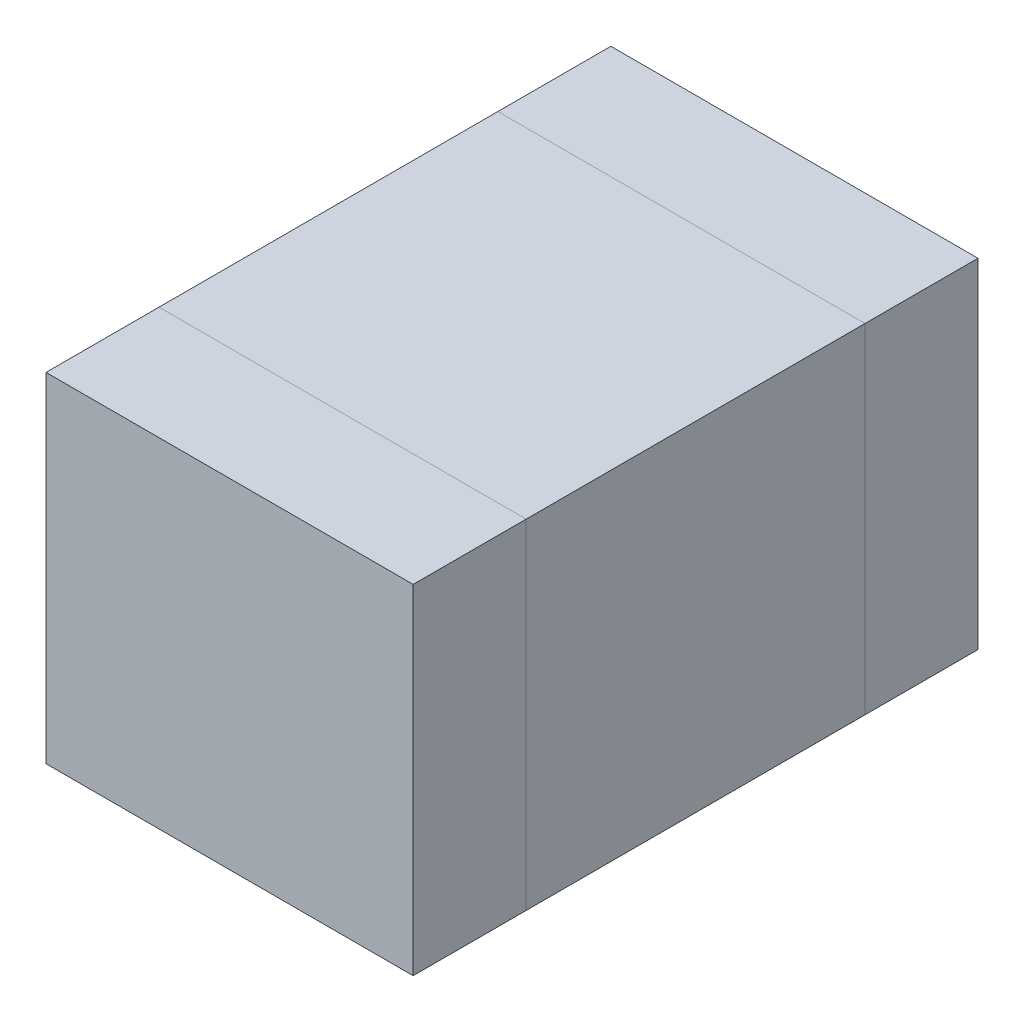
ISO-10303-21;
HEADER;
FILE_DESCRIPTION(('STEP AP214'),'2;1');
FILE_NAME('part.step','',(''),(''),'','','');
FILE_SCHEMA(('AUTOMOTIVE_DESIGN { 1 0 10303 214 1 1 1 1 }'));
ENDSEC;
DATA;
#1=APPLICATION_CONTEXT('core data for automotive mechanical design processes');
#2=APPLICATION_PROTOCOL_DEFINITION('international standard','automotive_design',2000,#1);
#3=PRODUCT_CONTEXT('',#1,'mechanical');
#4=PRODUCT('Part','Part','',(#3));
#5=PRODUCT_RELATED_PRODUCT_CATEGORY('part','',(#4));
#6=PRODUCT_DEFINITION_FORMATION('','',#4);
#7=PRODUCT_DEFINITION_CONTEXT('part definition',#1,'design');
#8=PRODUCT_DEFINITION('design','',#6,#7);
#9=PRODUCT_DEFINITION_SHAPE('','',#8);
#10=(LENGTH_UNIT() NAMED_UNIT(*) SI_UNIT(.MILLI.,.METRE.));
#11=(NAMED_UNIT(*) PLANE_ANGLE_UNIT() SI_UNIT($,.RADIAN.));
#12=(NAMED_UNIT(*) SI_UNIT($,.STERADIAN.) SOLID_ANGLE_UNIT());
#13=UNCERTAINTY_MEASURE_WITH_UNIT(LENGTH_MEASURE(1.E-05),#10,'distance_accuracy_value','');
#14=(GEOMETRIC_REPRESENTATION_CONTEXT(3) GLOBAL_UNCERTAINTY_ASSIGNED_CONTEXT((#13)) GLOBAL_UNIT_ASSIGNED_CONTEXT((#10,
#11,#12)) REPRESENTATION_CONTEXT('',''));
#15=CARTESIAN_POINT('',(0.,0.,0.));
#16=DIRECTION('',(0.,0.,1.));
#17=DIRECTION('',(1.,0.,0.));
#18=AXIS2_PLACEMENT_3D('',#15,#16,#17);
#19=CARTESIAN_POINT('',(0.65,1.2,-1.));
#20=DIRECTION('',(-1.,0.,0.));
#21=DIRECTION('',(0.,0.,1.));
#22=AXIS2_PLACEMENT_3D('',#19,#20,#21);
#23=PLANE('',#22);
#24=DIRECTION('',(0.,-1.,0.));
#25=VECTOR('',#24,1.);
#26=CARTESIAN_POINT('',(0.65,1.2,-0.6));
#27=LINE('',#26,#25);
#28=CARTESIAN_POINT('',(0.65,1.2,-0.6));
#29=VERTEX_POINT('',#28);
#30=CARTESIAN_POINT('',(0.65,0.,-0.6));
#31=VERTEX_POINT('',#30);
#32=EDGE_CURVE('E107',#29,#31,#27,.T.);
#33=ORIENTED_EDGE('',*,*,#32,.T.);
#34=DIRECTION('',(0.,0.,1.));
#35=VECTOR('',#34,1.);
#36=CARTESIAN_POINT('',(0.65,0.,-1.));
#37=LINE('',#36,#35);
#38=CARTESIAN_POINT('',(0.65,0.,-1.));
#39=VERTEX_POINT('',#38);
#40=EDGE_CURVE('E12',#39,#31,#37,.T.);
#41=ORIENTED_EDGE('',*,*,#40,.F.);
#42=DIRECTION('',(0.,-1.,0.));
#43=VECTOR('',#42,1.);
#44=CARTESIAN_POINT('',(0.65,1.2,-1.));
#45=LINE('',#44,#43);
#46=CARTESIAN_POINT('',(0.65,1.2,-1.));
#47=VERTEX_POINT('',#46);
#48=EDGE_CURVE('E95',#47,#39,#45,.T.);
#49=ORIENTED_EDGE('',*,*,#48,.F.);
#50=DIRECTION('',(0.,0.,1.));
#51=VECTOR('',#50,1.);
#52=CARTESIAN_POINT('',(0.65,1.2,-1.));
#53=LINE('',#52,#51);
#54=EDGE_CURVE('E103',#47,#29,#53,.T.);
#55=ORIENTED_EDGE('',*,*,#54,.T.);
#56=EDGE_LOOP('',(#33,#41,#49,#55));
#57=FACE_BOUND('',#56,.T.);
#58=ADVANCED_FACE('F44',(#57),#23,.F.);
#59=CARTESIAN_POINT('',(0.65,0.,-1.));
#60=DIRECTION('',(0.,1.,0.));
#61=DIRECTION('',(0.,0.,1.));
#62=AXIS2_PLACEMENT_3D('',#59,#60,#61);
#63=PLANE('',#62);
#64=DIRECTION('',(-1.,0.,0.));
#65=VECTOR('',#64,1.);
#66=CARTESIAN_POINT('',(0.65,0.,-0.6));
#67=LINE('',#66,#65);
#68=CARTESIAN_POINT('',(-0.65,0.,-0.6));
#69=VERTEX_POINT('',#68);
#70=EDGE_CURVE('E99',#31,#69,#67,.T.);
#71=ORIENTED_EDGE('',*,*,#70,.T.);
#72=DIRECTION('',(0.,0.,1.));
#73=VECTOR('',#72,1.);
#74=CARTESIAN_POINT('',(-0.65,0.,-1.));
#75=LINE('',#74,#73);
#76=CARTESIAN_POINT('',(-0.65,0.,-1.));
#77=VERTEX_POINT('',#76);
#78=EDGE_CURVE('E52',#77,#69,#75,.T.);
#79=ORIENTED_EDGE('',*,*,#78,.F.);
#80=DIRECTION('',(-1.,0.,0.));
#81=VECTOR('',#80,1.);
#82=CARTESIAN_POINT('',(0.65,0.,-1.));
#83=LINE('',#82,#81);
#84=EDGE_CURVE('E90',#39,#77,#83,.T.);
#85=ORIENTED_EDGE('',*,*,#84,.F.);
#86=ORIENTED_EDGE('',*,*,#40,.T.);
#87=EDGE_LOOP('',(#71,#79,#85,#86));
#88=FACE_BOUND('',#87,.T.);
#89=ADVANCED_FACE('F98',(#88),#63,.F.);
#90=CARTESIAN_POINT('',(-0.65,0.,-1.));
#91=DIRECTION('',(1.,0.,0.));
#92=DIRECTION('',(0.,0.,-1.));
#93=AXIS2_PLACEMENT_3D('',#90,#91,#92);
#94=PLANE('',#93);
#95=DIRECTION('',(0.,1.,0.));
#96=VECTOR('',#95,1.);
#97=CARTESIAN_POINT('',(-0.65,0.,-0.6));
#98=LINE('',#97,#96);
#99=CARTESIAN_POINT('',(-0.65,1.2,-0.6));
#100=VERTEX_POINT('',#99);
#101=EDGE_CURVE('E77',#69,#100,#98,.T.);
#102=ORIENTED_EDGE('',*,*,#101,.T.);
#103=DIRECTION('',(0.,0.,1.));
#104=VECTOR('',#103,1.);
#105=CARTESIAN_POINT('',(-0.65,1.2,-1.));
#106=LINE('',#105,#104);
#107=CARTESIAN_POINT('',(-0.65,1.2,-1.));
#108=VERTEX_POINT('',#107);
#109=EDGE_CURVE('E100',#108,#100,#106,.T.);
#110=ORIENTED_EDGE('',*,*,#109,.F.);
#111=DIRECTION('',(0.,1.,0.));
#112=VECTOR('',#111,1.);
#113=CARTESIAN_POINT('',(-0.65,0.,-1.));
#114=LINE('',#113,#112);
#115=EDGE_CURVE('E93',#77,#108,#114,.T.);
#116=ORIENTED_EDGE('',*,*,#115,.F.);
#117=ORIENTED_EDGE('',*,*,#78,.T.);
#118=EDGE_LOOP('',(#102,#110,#116,#117));
#119=FACE_BOUND('',#118,.T.);
#120=ADVANCED_FACE('F101',(#119),#94,.F.);
#121=CARTESIAN_POINT('',(-0.65,1.2,-1.));
#122=DIRECTION('',(0.,-1.,0.));
#123=DIRECTION('',(0.,0.,-1.));
#124=AXIS2_PLACEMENT_3D('',#121,#122,#123);
#125=PLANE('',#124);
#126=DIRECTION('',(1.,0.,0.));
#127=VECTOR('',#126,1.);
#128=CARTESIAN_POINT('',(-0.65,1.2,-0.6));
#129=LINE('',#128,#127);
#130=EDGE_CURVE('E83',#100,#29,#129,.T.);
#131=ORIENTED_EDGE('',*,*,#130,.T.);
#132=ORIENTED_EDGE('',*,*,#54,.F.);
#133=DIRECTION('',(1.,0.,0.));
#134=VECTOR('',#133,1.);
#135=CARTESIAN_POINT('',(-0.65,1.2,-1.));
#136=LINE('',#135,#134);
#137=EDGE_CURVE('E60',#108,#47,#136,.T.);
#138=ORIENTED_EDGE('',*,*,#137,.F.);
#139=ORIENTED_EDGE('',*,*,#109,.T.);
#140=EDGE_LOOP('',(#131,#132,#138,#139));
#141=FACE_BOUND('',#140,.T.);
#142=ADVANCED_FACE('F114',(#141),#125,.F.);
#143=CARTESIAN_POINT('',(0.,0.,-1.));
#144=DIRECTION('',(0.,0.,-1.));
#145=DIRECTION('',(-1.,0.,0.));
#146=AXIS2_PLACEMENT_3D('',#143,#144,#145);
#147=PLANE('',#146);
#148=ORIENTED_EDGE('',*,*,#48,.T.);
#149=ORIENTED_EDGE('',*,*,#84,.T.);
#150=ORIENTED_EDGE('',*,*,#115,.T.);
#151=ORIENTED_EDGE('',*,*,#137,.T.);
#152=EDGE_LOOP('',(#148,#149,#150,#151));
#153=FACE_BOUND('',#152,.T.);
#154=ADVANCED_FACE('F91',(#153),#147,.T.);
#155=CARTESIAN_POINT('',(0.,0.,-0.6));
#156=DIRECTION('',(0.,0.,-1.));
#157=DIRECTION('',(-1.,0.,0.));
#158=AXIS2_PLACEMENT_3D('',#155,#156,#157);
#159=PLANE('',#158);
#160=ORIENTED_EDGE('',*,*,#32,.F.);
#161=ORIENTED_EDGE('',*,*,#130,.F.);
#162=ORIENTED_EDGE('',*,*,#101,.F.);
#163=ORIENTED_EDGE('',*,*,#70,.F.);
#164=EDGE_LOOP('',(#160,#161,#162,#163));
#165=FACE_BOUND('',#164,.T.);
#166=ADVANCED_FACE('F117',(#165),#159,.F.);
#167=CLOSED_SHELL('',(#58,#89,#120,#142,#154,#166));
#168=MANIFOLD_SOLID_BREP('B2',#167);
#169=CARTESIAN_POINT('',(-0.65,1.2,1.));
#170=DIRECTION('',(1.,0.,0.));
#171=DIRECTION('',(0.,0.,-1.));
#172=AXIS2_PLACEMENT_3D('',#169,#170,#171);
#173=PLANE('',#172);
#174=DIRECTION('',(0.,-1.,0.));
#175=VECTOR('',#174,1.);
#176=CARTESIAN_POINT('',(-0.65,1.2,0.6));
#177=LINE('',#176,#175);
#178=CARTESIAN_POINT('',(-0.65,1.2,0.6));
#179=VERTEX_POINT('',#178);
#180=CARTESIAN_POINT('',(-0.65,0.,0.6));
#181=VERTEX_POINT('',#180);
#182=EDGE_CURVE('E240',#179,#181,#177,.T.);
#183=ORIENTED_EDGE('',*,*,#182,.T.);
#184=DIRECTION('',(0.,0.,-1.));
#185=VECTOR('',#184,1.);
#186=CARTESIAN_POINT('',(-0.65,0.,1.));
#187=LINE('',#186,#185);
#188=CARTESIAN_POINT('',(-0.65,0.,1.));
#189=VERTEX_POINT('',#188);
#190=EDGE_CURVE('E42',#189,#181,#187,.T.);
#191=ORIENTED_EDGE('',*,*,#190,.F.);
#192=DIRECTION('',(0.,-1.,0.));
#193=VECTOR('',#192,1.);
#194=CARTESIAN_POINT('',(-0.65,1.2,1.));
#195=LINE('',#194,#193);
#196=CARTESIAN_POINT('',(-0.65,1.2,1.));
#197=VERTEX_POINT('',#196);
#198=EDGE_CURVE('E228',#197,#189,#195,.T.);
#199=ORIENTED_EDGE('',*,*,#198,.F.);
#200=DIRECTION('',(0.,0.,-1.));
#201=VECTOR('',#200,1.);
#202=CARTESIAN_POINT('',(-0.65,1.2,1.));
#203=LINE('',#202,#201);
#204=EDGE_CURVE('E236',#197,#179,#203,.T.);
#205=ORIENTED_EDGE('',*,*,#204,.T.);
#206=EDGE_LOOP('',(#183,#191,#199,#205));
#207=FACE_BOUND('',#206,.T.);
#208=ADVANCED_FACE('F177',(#207),#173,.F.);
#209=CARTESIAN_POINT('',(-0.65,0.,1.));
#210=DIRECTION('',(0.,1.,0.));
#211=DIRECTION('',(0.,0.,1.));
#212=AXIS2_PLACEMENT_3D('',#209,#210,#211);
#213=PLANE('',#212);
#214=DIRECTION('',(1.,0.,0.));
#215=VECTOR('',#214,1.);
#216=CARTESIAN_POINT('',(-0.65,0.,0.6));
#217=LINE('',#216,#215);
#218=CARTESIAN_POINT('',(0.65,0.,0.6));
#219=VERTEX_POINT('',#218);
#220=EDGE_CURVE('E232',#181,#219,#217,.T.);
#221=ORIENTED_EDGE('',*,*,#220,.T.);
#222=DIRECTION('',(0.,0.,-1.));
#223=VECTOR('',#222,1.);
#224=CARTESIAN_POINT('',(0.65,0.,1.));
#225=LINE('',#224,#223);
#226=CARTESIAN_POINT('',(0.65,0.,1.));
#227=VERTEX_POINT('',#226);
#228=EDGE_CURVE('E185',#227,#219,#225,.T.);
#229=ORIENTED_EDGE('',*,*,#228,.F.);
#230=DIRECTION('',(1.,0.,0.));
#231=VECTOR('',#230,1.);
#232=CARTESIAN_POINT('',(-0.65,0.,1.));
#233=LINE('',#232,#231);
#234=EDGE_CURVE('E223',#189,#227,#233,.T.);
#235=ORIENTED_EDGE('',*,*,#234,.F.);
#236=ORIENTED_EDGE('',*,*,#190,.T.);
#237=EDGE_LOOP('',(#221,#229,#235,#236));
#238=FACE_BOUND('',#237,.T.);
#239=ADVANCED_FACE('F231',(#238),#213,.F.);
#240=CARTESIAN_POINT('',(0.65,0.,1.));
#241=DIRECTION('',(-1.,0.,0.));
#242=DIRECTION('',(0.,0.,1.));
#243=AXIS2_PLACEMENT_3D('',#240,#241,#242);
#244=PLANE('',#243);
#245=DIRECTION('',(0.,1.,0.));
#246=VECTOR('',#245,1.);
#247=CARTESIAN_POINT('',(0.65,0.,0.6));
#248=LINE('',#247,#246);
#249=CARTESIAN_POINT('',(0.65,1.2,0.6));
#250=VERTEX_POINT('',#249);
#251=EDGE_CURVE('E210',#219,#250,#248,.T.);
#252=ORIENTED_EDGE('',*,*,#251,.T.);
#253=DIRECTION('',(0.,0.,-1.));
#254=VECTOR('',#253,1.);
#255=CARTESIAN_POINT('',(0.65,1.2,1.));
#256=LINE('',#255,#254);
#257=CARTESIAN_POINT('',(0.65,1.2,1.));
#258=VERTEX_POINT('',#257);
#259=EDGE_CURVE('E233',#258,#250,#256,.T.);
#260=ORIENTED_EDGE('',*,*,#259,.F.);
#261=DIRECTION('',(0.,1.,0.));
#262=VECTOR('',#261,1.);
#263=CARTESIAN_POINT('',(0.65,0.,1.));
#264=LINE('',#263,#262);
#265=EDGE_CURVE('E226',#227,#258,#264,.T.);
#266=ORIENTED_EDGE('',*,*,#265,.F.);
#267=ORIENTED_EDGE('',*,*,#228,.T.);
#268=EDGE_LOOP('',(#252,#260,#266,#267));
#269=FACE_BOUND('',#268,.T.);
#270=ADVANCED_FACE('F234',(#269),#244,.F.);
#271=CARTESIAN_POINT('',(0.65,1.2,1.));
#272=DIRECTION('',(0.,-1.,0.));
#273=DIRECTION('',(0.,0.,-1.));
#274=AXIS2_PLACEMENT_3D('',#271,#272,#273);
#275=PLANE('',#274);
#276=DIRECTION('',(-1.,0.,0.));
#277=VECTOR('',#276,1.);
#278=CARTESIAN_POINT('',(0.65,1.2,0.6));
#279=LINE('',#278,#277);
#280=EDGE_CURVE('E216',#250,#179,#279,.T.);
#281=ORIENTED_EDGE('',*,*,#280,.T.);
#282=ORIENTED_EDGE('',*,*,#204,.F.);
#283=DIRECTION('',(-1.,0.,0.));
#284=VECTOR('',#283,1.);
#285=CARTESIAN_POINT('',(0.65,1.2,1.));
#286=LINE('',#285,#284);
#287=EDGE_CURVE('E193',#258,#197,#286,.T.);
#288=ORIENTED_EDGE('',*,*,#287,.F.);
#289=ORIENTED_EDGE('',*,*,#259,.T.);
#290=EDGE_LOOP('',(#281,#282,#288,#289));
#291=FACE_BOUND('',#290,.T.);
#292=ADVANCED_FACE('F247',(#291),#275,.F.);
#293=CARTESIAN_POINT('',(0.,0.,1.));
#294=DIRECTION('',(0.,0.,1.));
#295=DIRECTION('',(1.,0.,0.));
#296=AXIS2_PLACEMENT_3D('',#293,#294,#295);
#297=PLANE('',#296);
#298=ORIENTED_EDGE('',*,*,#198,.T.);
#299=ORIENTED_EDGE('',*,*,#234,.T.);
#300=ORIENTED_EDGE('',*,*,#265,.T.);
#301=ORIENTED_EDGE('',*,*,#287,.T.);
#302=EDGE_LOOP('',(#298,#299,#300,#301));
#303=FACE_BOUND('',#302,.T.);
#304=ADVANCED_FACE('F224',(#303),#297,.T.);
#305=CARTESIAN_POINT('',(0.,0.,0.6));
#306=DIRECTION('',(0.,0.,1.));
#307=DIRECTION('',(1.,0.,0.));
#308=AXIS2_PLACEMENT_3D('',#305,#306,#307);
#309=PLANE('',#308);
#310=ORIENTED_EDGE('',*,*,#182,.F.);
#311=ORIENTED_EDGE('',*,*,#280,.F.);
#312=ORIENTED_EDGE('',*,*,#251,.F.);
#313=ORIENTED_EDGE('',*,*,#220,.F.);
#314=EDGE_LOOP('',(#310,#311,#312,#313));
#315=FACE_BOUND('',#314,.T.);
#316=ADVANCED_FACE('F250',(#315),#309,.F.);
#317=CLOSED_SHELL('',(#208,#239,#270,#292,#304,#316));
#318=MANIFOLD_SOLID_BREP('B6',#317);
#319=CARTESIAN_POINT('',(0.65,1.2,-0.6));
#320=DIRECTION('',(-1.,0.,0.));
#321=DIRECTION('',(0.,0.,1.));
#322=AXIS2_PLACEMENT_3D('',#319,#320,#321);
#323=PLANE('',#322);
#324=DIRECTION('',(0.,0.,-1.));
#325=VECTOR('',#324,1.);
#326=CARTESIAN_POINT('',(0.65,0.,-0.6));
#327=LINE('',#326,#325);
#328=CARTESIAN_POINT('',(0.65,0.,0.6));
#329=VERTEX_POINT('',#328);
#330=CARTESIAN_POINT('',(0.65,0.,-0.6));
#331=VERTEX_POINT('',#330);
#332=EDGE_CURVE('E364',#329,#331,#327,.T.);
#333=ORIENTED_EDGE('',*,*,#332,.T.);
#334=DIRECTION('',(0.,-1.,0.));
#335=VECTOR('',#334,1.);
#336=CARTESIAN_POINT('',(0.65,1.2,-0.6));
#337=LINE('',#336,#335);
#338=CARTESIAN_POINT('',(0.65,1.2,-0.6));
#339=VERTEX_POINT('',#338);
#340=EDGE_CURVE('E175',#339,#331,#337,.T.);
#341=ORIENTED_EDGE('',*,*,#340,.F.);
#342=DIRECTION('',(0.,0.,-1.));
#343=VECTOR('',#342,1.);
#344=CARTESIAN_POINT('',(0.65,1.2,-0.6));
#345=LINE('',#344,#343);
#346=CARTESIAN_POINT('',(0.65,1.2,0.6));
#347=VERTEX_POINT('',#346);
#348=EDGE_CURVE('E352',#347,#339,#345,.T.);
#349=ORIENTED_EDGE('',*,*,#348,.F.);
#350=DIRECTION('',(0.,-1.,0.));
#351=VECTOR('',#350,1.);
#352=CARTESIAN_POINT('',(0.65,1.2,0.6));
#353=LINE('',#352,#351);
#354=EDGE_CURVE('E360',#347,#329,#353,.T.);
#355=ORIENTED_EDGE('',*,*,#354,.T.);
#356=EDGE_LOOP('',(#333,#341,#349,#355));
#357=FACE_BOUND('',#356,.T.);
#358=ADVANCED_FACE('F301',(#357),#323,.F.);
#359=CARTESIAN_POINT('',(-0.65,1.2,-0.6));
#360=DIRECTION('',(0.,0.,1.));
#361=DIRECTION('',(1.,0.,0.));
#362=AXIS2_PLACEMENT_3D('',#359,#360,#361);
#363=PLANE('',#362);
#364=DIRECTION('',(-1.,0.,0.));
#365=VECTOR('',#364,1.);
#366=CARTESIAN_POINT('',(-0.65,0.,-0.6));
#367=LINE('',#366,#365);
#368=CARTESIAN_POINT('',(-0.65,0.,-0.6));
#369=VERTEX_POINT('',#368);
#370=EDGE_CURVE('E356',#331,#369,#367,.T.);
#371=ORIENTED_EDGE('',*,*,#370,.T.);
#372=DIRECTION('',(0.,-1.,0.));
#373=VECTOR('',#372,1.);
#374=CARTESIAN_POINT('',(-0.65,1.2,-0.6));
#375=LINE('',#374,#373);
#376=CARTESIAN_POINT('',(-0.65,1.2,-0.6));
#377=VERTEX_POINT('',#376);
#378=EDGE_CURVE('E309',#377,#369,#375,.T.);
#379=ORIENTED_EDGE('',*,*,#378,.F.);
#380=DIRECTION('',(-1.,0.,0.));
#381=VECTOR('',#380,1.);
#382=CARTESIAN_POINT('',(-0.65,1.2,-0.6));
#383=LINE('',#382,#381);
#384=EDGE_CURVE('E347',#339,#377,#383,.T.);
#385=ORIENTED_EDGE('',*,*,#384,.F.);
#386=ORIENTED_EDGE('',*,*,#340,.T.);
#387=EDGE_LOOP('',(#371,#379,#385,#386));
#388=FACE_BOUND('',#387,.T.);
#389=ADVANCED_FACE('F355',(#388),#363,.F.);
#390=CARTESIAN_POINT('',(-0.65,1.2,-0.6));
#391=DIRECTION('',(1.,0.,0.));
#392=DIRECTION('',(0.,0.,-1.));
#393=AXIS2_PLACEMENT_3D('',#390,#391,#392);
#394=PLANE('',#393);
#395=DIRECTION('',(0.,0.,1.));
#396=VECTOR('',#395,1.);
#397=CARTESIAN_POINT('',(-0.65,0.,-0.6));
#398=LINE('',#397,#396);
#399=CARTESIAN_POINT('',(-0.65,0.,0.6));
#400=VERTEX_POINT('',#399);
#401=EDGE_CURVE('E334',#369,#400,#398,.T.);
#402=ORIENTED_EDGE('',*,*,#401,.T.);
#403=DIRECTION('',(0.,-1.,0.));
#404=VECTOR('',#403,1.);
#405=CARTESIAN_POINT('',(-0.65,1.2,0.6));
#406=LINE('',#405,#404);
#407=CARTESIAN_POINT('',(-0.65,1.2,0.6));
#408=VERTEX_POINT('',#407);
#409=EDGE_CURVE('E357',#408,#400,#406,.T.);
#410=ORIENTED_EDGE('',*,*,#409,.F.);
#411=DIRECTION('',(0.,0.,1.));
#412=VECTOR('',#411,1.);
#413=CARTESIAN_POINT('',(-0.65,1.2,-0.6));
#414=LINE('',#413,#412);
#415=EDGE_CURVE('E350',#377,#408,#414,.T.);
#416=ORIENTED_EDGE('',*,*,#415,.F.);
#417=ORIENTED_EDGE('',*,*,#378,.T.);
#418=EDGE_LOOP('',(#402,#410,#416,#417));
#419=FACE_BOUND('',#418,.T.);
#420=ADVANCED_FACE('F358',(#419),#394,.F.);
#421=CARTESIAN_POINT('',(-0.65,1.2,0.6));
#422=DIRECTION('',(0.,0.,-1.));
#423=DIRECTION('',(-1.,0.,0.));
#424=AXIS2_PLACEMENT_3D('',#421,#422,#423);
#425=PLANE('',#424);
#426=DIRECTION('',(1.,0.,0.));
#427=VECTOR('',#426,1.);
#428=CARTESIAN_POINT('',(-0.65,0.,0.6));
#429=LINE('',#428,#427);
#430=EDGE_CURVE('E340',#400,#329,#429,.T.);
#431=ORIENTED_EDGE('',*,*,#430,.T.);
#432=ORIENTED_EDGE('',*,*,#354,.F.);
#433=DIRECTION('',(1.,0.,0.));
#434=VECTOR('',#433,1.);
#435=CARTESIAN_POINT('',(-0.65,1.2,0.6));
#436=LINE('',#435,#434);
#437=EDGE_CURVE('E317',#408,#347,#436,.T.);
#438=ORIENTED_EDGE('',*,*,#437,.F.);
#439=ORIENTED_EDGE('',*,*,#409,.T.);
#440=EDGE_LOOP('',(#431,#432,#438,#439));
#441=FACE_BOUND('',#440,.T.);
#442=ADVANCED_FACE('F371',(#441),#425,.F.);
#443=CARTESIAN_POINT('',(0.,1.2,0.));
#444=DIRECTION('',(0.,1.,0.));
#445=DIRECTION('',(0.,0.,1.));
#446=AXIS2_PLACEMENT_3D('',#443,#444,#445);
#447=PLANE('',#446);
#448=ORIENTED_EDGE('',*,*,#348,.T.);
#449=ORIENTED_EDGE('',*,*,#384,.T.);
#450=ORIENTED_EDGE('',*,*,#415,.T.);
#451=ORIENTED_EDGE('',*,*,#437,.T.);
#452=EDGE_LOOP('',(#448,#449,#450,#451));
#453=FACE_BOUND('',#452,.T.);
#454=ADVANCED_FACE('F348',(#453),#447,.T.);
#455=CARTESIAN_POINT('',(0.,0.,0.));
#456=DIRECTION('',(0.,1.,0.));
#457=DIRECTION('',(0.,0.,1.));
#458=AXIS2_PLACEMENT_3D('',#455,#456,#457);
#459=PLANE('',#458);
#460=ORIENTED_EDGE('',*,*,#332,.F.);
#461=ORIENTED_EDGE('',*,*,#430,.F.);
#462=ORIENTED_EDGE('',*,*,#401,.F.);
#463=ORIENTED_EDGE('',*,*,#370,.F.);
#464=EDGE_LOOP('',(#460,#461,#462,#463));
#465=FACE_BOUND('',#464,.T.);
#466=ADVANCED_FACE('F374',(#465),#459,.F.);
#467=CLOSED_SHELL('',(#358,#389,#420,#442,#454,#466));
#468=MANIFOLD_SOLID_BREP('B36',#467);
#469=ADVANCED_BREP_SHAPE_REPRESENTATION('',(#18,#168,#318,#468),#14);
#470=SHAPE_DEFINITION_REPRESENTATION(#9,#469);
ENDSEC;
END-ISO-10303-21;
